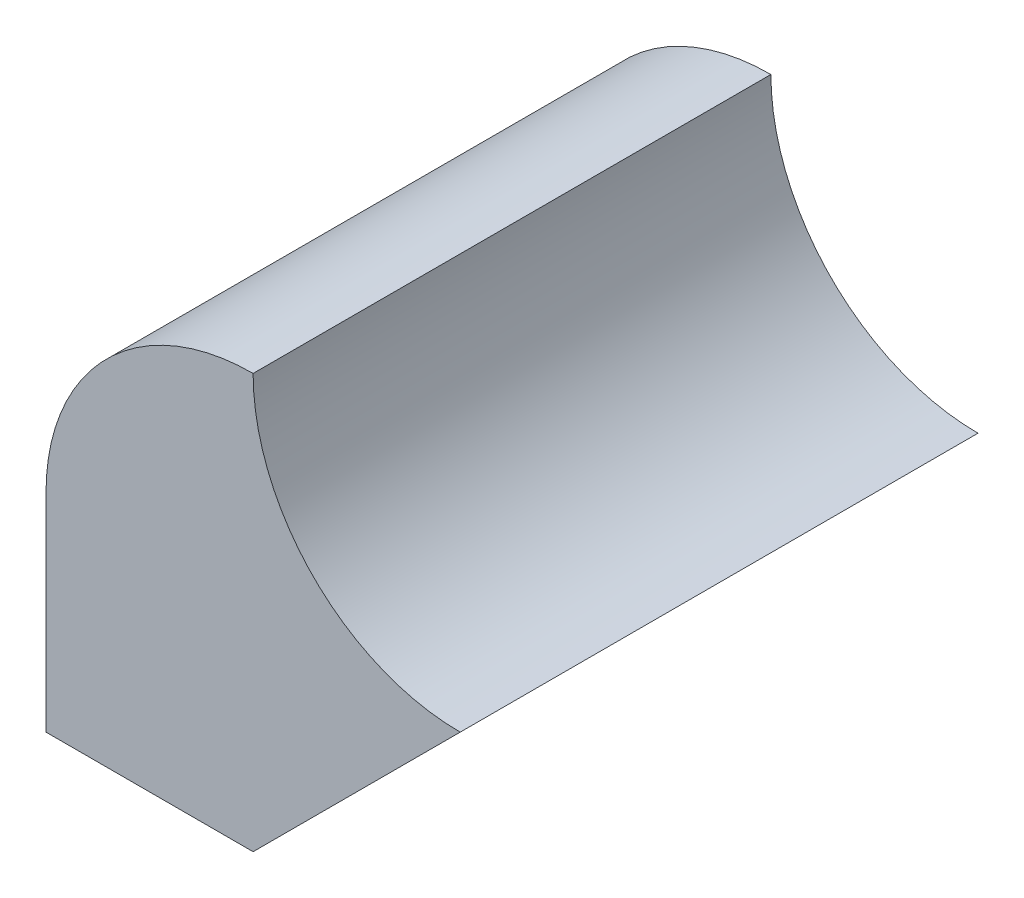
ISO-10303-21;
HEADER;
FILE_DESCRIPTION(('STEP AP214'),'2;1');
FILE_NAME('part.step','',(''),(''),'','','');
FILE_SCHEMA(('AUTOMOTIVE_DESIGN { 1 0 10303 214 1 1 1 1 }'));
ENDSEC;
DATA;
#1=APPLICATION_CONTEXT('core data for automotive mechanical design processes');
#2=APPLICATION_PROTOCOL_DEFINITION('international standard','automotive_design',2000,#1);
#3=PRODUCT_CONTEXT('',#1,'mechanical');
#4=PRODUCT('Part','Part','',(#3));
#5=PRODUCT_RELATED_PRODUCT_CATEGORY('part','',(#4));
#6=PRODUCT_DEFINITION_FORMATION('','',#4);
#7=PRODUCT_DEFINITION_CONTEXT('part definition',#1,'design');
#8=PRODUCT_DEFINITION('design','',#6,#7);
#9=PRODUCT_DEFINITION_SHAPE('','',#8);
#10=(LENGTH_UNIT() NAMED_UNIT(*) SI_UNIT(.MILLI.,.METRE.));
#11=(NAMED_UNIT(*) PLANE_ANGLE_UNIT() SI_UNIT($,.RADIAN.));
#12=(NAMED_UNIT(*) SI_UNIT($,.STERADIAN.) SOLID_ANGLE_UNIT());
#13=UNCERTAINTY_MEASURE_WITH_UNIT(LENGTH_MEASURE(1.E-05),#10,'distance_accuracy_value','');
#14=(GEOMETRIC_REPRESENTATION_CONTEXT(3) GLOBAL_UNCERTAINTY_ASSIGNED_CONTEXT((#13)) GLOBAL_UNIT_ASSIGNED_CONTEXT((#10,
#11,#12)) REPRESENTATION_CONTEXT('',''));
#15=CARTESIAN_POINT('',(0.,0.,0.));
#16=DIRECTION('',(0.,0.,1.));
#17=DIRECTION('',(1.,0.,0.));
#18=AXIS2_PLACEMENT_3D('',#15,#16,#17);
#19=CARTESIAN_POINT('',(-9.99999999999999,0.,25.));
#20=DIRECTION('',(0.,0.,-1.));
#21=DIRECTION('',(-1.,0.,0.));
#22=AXIS2_PLACEMENT_3D('',#19,#20,#21);
#23=CYLINDRICAL_SURFACE('',#22,10.);
#24=CARTESIAN_POINT('',(-9.99999999999999,0.,0.));
#25=DIRECTION('',(0.,0.,1.));
#26=DIRECTION('',(-1.,0.,0.));
#27=AXIS2_PLACEMENT_3D('',#24,#25,#26);
#28=CIRCLE('',#27,10.);
#29=CARTESIAN_POINT('',(-10.,10.,0.));
#30=VERTEX_POINT('',#29);
#31=CARTESIAN_POINT('',(-20.,0.,0.));
#32=VERTEX_POINT('',#31);
#33=EDGE_CURVE('E107',#30,#32,#28,.T.);
#34=ORIENTED_EDGE('',*,*,#33,.T.);
#35=DIRECTION('',(0.,0.,-1.));
#36=VECTOR('',#35,1.);
#37=CARTESIAN_POINT('',(-20.,0.,25.));
#38=LINE('',#37,#36);
#39=CARTESIAN_POINT('',(-20.,0.,25.));
#40=VERTEX_POINT('',#39);
#41=EDGE_CURVE('E11',#40,#32,#38,.T.);
#42=ORIENTED_EDGE('',*,*,#41,.F.);
#43=CARTESIAN_POINT('',(-9.99999999999999,0.,25.));
#44=DIRECTION('',(0.,0.,1.));
#45=DIRECTION('',(-1.,0.,0.));
#46=AXIS2_PLACEMENT_3D('',#43,#44,#45);
#47=CIRCLE('',#46,10.);
#48=CARTESIAN_POINT('',(-10.,10.,25.));
#49=VERTEX_POINT('',#48);
#50=EDGE_CURVE('E115',#49,#40,#47,.T.);
#51=ORIENTED_EDGE('',*,*,#50,.F.);
#52=DIRECTION('',(0.,0.,-1.));
#53=VECTOR('',#52,1.);
#54=CARTESIAN_POINT('',(-10.,10.,25.));
#55=LINE('',#54,#53);
#56=EDGE_CURVE('E103',#49,#30,#55,.T.);
#57=ORIENTED_EDGE('',*,*,#56,.T.);
#58=EDGE_LOOP('',(#34,#42,#51,#57));
#59=FACE_BOUND('',#58,.T.);
#60=ADVANCED_FACE('F33',(#59),#23,.T.);
#61=CARTESIAN_POINT('',(-20.,0.,25.));
#62=DIRECTION('',(1.,0.,0.));
#63=DIRECTION('',(0.,0.,-1.));
#64=AXIS2_PLACEMENT_3D('',#61,#62,#63);
#65=PLANE('',#64);
#66=DIRECTION('',(0.,-1.,0.));
#67=VECTOR('',#66,1.);
#68=CARTESIAN_POINT('',(-20.,0.,0.));
#69=LINE('',#68,#67);
#70=CARTESIAN_POINT('',(-20.,-10.,0.));
#71=VERTEX_POINT('',#70);
#72=EDGE_CURVE('E110',#32,#71,#69,.T.);
#73=ORIENTED_EDGE('',*,*,#72,.T.);
#74=DIRECTION('',(0.,0.,-1.));
#75=VECTOR('',#74,1.);
#76=CARTESIAN_POINT('',(-20.,-10.,25.));
#77=LINE('',#76,#75);
#78=CARTESIAN_POINT('',(-20.,-10.,25.));
#79=VERTEX_POINT('',#78);
#80=EDGE_CURVE('E41',#79,#71,#77,.T.);
#81=ORIENTED_EDGE('',*,*,#80,.F.);
#82=DIRECTION('',(0.,-1.,0.));
#83=VECTOR('',#82,1.);
#84=CARTESIAN_POINT('',(-20.,0.,25.));
#85=LINE('',#84,#83);
#86=EDGE_CURVE('E83',#40,#79,#85,.T.);
#87=ORIENTED_EDGE('',*,*,#86,.F.);
#88=ORIENTED_EDGE('',*,*,#41,.T.);
#89=EDGE_LOOP('',(#73,#81,#87,#88));
#90=FACE_BOUND('',#89,.T.);
#91=ADVANCED_FACE('F134',(#90),#65,.F.);
#92=CARTESIAN_POINT('',(-20.,-10.,25.));
#93=DIRECTION('',(0.,1.,0.));
#94=DIRECTION('',(0.,0.,1.));
#95=AXIS2_PLACEMENT_3D('',#92,#93,#94);
#96=PLANE('',#95);
#97=DIRECTION('',(1.,0.,0.));
#98=VECTOR('',#97,1.);
#99=CARTESIAN_POINT('',(-20.,-10.,0.));
#100=LINE('',#99,#98);
#101=CARTESIAN_POINT('',(-10.,-10.,0.));
#102=VERTEX_POINT('',#101);
#103=EDGE_CURVE('E98',#71,#102,#100,.T.);
#104=ORIENTED_EDGE('',*,*,#103,.T.);
#105=DIRECTION('',(0.,0.,-1.));
#106=VECTOR('',#105,1.);
#107=CARTESIAN_POINT('',(-10.,-10.,25.));
#108=LINE('',#107,#106);
#109=CARTESIAN_POINT('',(-10.,-10.,25.));
#110=VERTEX_POINT('',#109);
#111=EDGE_CURVE('E95',#110,#102,#108,.T.);
#112=ORIENTED_EDGE('',*,*,#111,.F.);
#113=DIRECTION('',(1.,0.,0.));
#114=VECTOR('',#113,1.);
#115=CARTESIAN_POINT('',(-20.,-10.,25.));
#116=LINE('',#115,#114);
#117=EDGE_CURVE('E87',#79,#110,#116,.T.);
#118=ORIENTED_EDGE('',*,*,#117,.F.);
#119=ORIENTED_EDGE('',*,*,#80,.T.);
#120=EDGE_LOOP('',(#104,#112,#118,#119));
#121=FACE_BOUND('',#120,.T.);
#122=ADVANCED_FACE('F96',(#121),#96,.F.);
#123=CARTESIAN_POINT('',(-10.,-10.,25.));
#124=DIRECTION('',(-0.707106781186548,0.707106781186547,0.));
#125=DIRECTION('',(-0.707106781186547,-0.707106781186548,0.));
#126=AXIS2_PLACEMENT_3D('',#123,#124,#125);
#127=PLANE('',#126);
#128=DIRECTION('',(0.707106781186547,0.707106781186548,0.));
#129=VECTOR('',#128,1.);
#130=CARTESIAN_POINT('',(-10.,-10.,0.));
#131=LINE('',#130,#129);
#132=CARTESIAN_POINT('',(0.,0.,0.));
#133=VERTEX_POINT('',#132);
#134=EDGE_CURVE('E69',#102,#133,#131,.T.);
#135=ORIENTED_EDGE('',*,*,#134,.T.);
#136=DIRECTION('',(0.,0.,-1.));
#137=VECTOR('',#136,1.);
#138=CARTESIAN_POINT('',(0.,0.,25.));
#139=LINE('',#138,#137);
#140=CARTESIAN_POINT('',(0.,0.,25.));
#141=VERTEX_POINT('',#140);
#142=EDGE_CURVE('E99',#141,#133,#139,.T.);
#143=ORIENTED_EDGE('',*,*,#142,.F.);
#144=DIRECTION('',(0.707106781186547,0.707106781186548,0.));
#145=VECTOR('',#144,1.);
#146=CARTESIAN_POINT('',(-10.,-10.,25.));
#147=LINE('',#146,#145);
#148=EDGE_CURVE('E91',#110,#141,#147,.T.);
#149=ORIENTED_EDGE('',*,*,#148,.F.);
#150=ORIENTED_EDGE('',*,*,#111,.T.);
#151=EDGE_LOOP('',(#135,#143,#149,#150));
#152=FACE_BOUND('',#151,.T.);
#153=ADVANCED_FACE('F101',(#152),#127,.F.);
#154=CARTESIAN_POINT('',(0.,10.,25.));
#155=DIRECTION('',(0.,0.,-1.));
#156=DIRECTION('',(-1.,0.,0.));
#157=AXIS2_PLACEMENT_3D('',#154,#155,#156);
#158=CYLINDRICAL_SURFACE('',#157,10.);
#159=CARTESIAN_POINT('',(0.,10.,0.));
#160=DIRECTION('',(0.,0.,-1.));
#161=DIRECTION('',(1.,0.,0.));
#162=AXIS2_PLACEMENT_3D('',#159,#160,#161);
#163=CIRCLE('',#162,10.);
#164=EDGE_CURVE('E75',#133,#30,#163,.T.);
#165=ORIENTED_EDGE('',*,*,#164,.T.);
#166=ORIENTED_EDGE('',*,*,#56,.F.);
#167=CARTESIAN_POINT('',(0.,10.,25.));
#168=DIRECTION('',(0.,0.,-1.));
#169=DIRECTION('',(1.,0.,0.));
#170=AXIS2_PLACEMENT_3D('',#167,#168,#169);
#171=CIRCLE('',#170,10.);
#172=EDGE_CURVE('E49',#141,#49,#171,.T.);
#173=ORIENTED_EDGE('',*,*,#172,.F.);
#174=ORIENTED_EDGE('',*,*,#142,.T.);
#175=EDGE_LOOP('',(#165,#166,#173,#174));
#176=FACE_BOUND('',#175,.T.);
#177=ADVANCED_FACE('F123',(#176),#158,.F.);
#178=CARTESIAN_POINT('',(-9.99999999999999,0.,25.));
#179=DIRECTION('',(0.,0.,-1.));
#180=DIRECTION('',(-1.,0.,0.));
#181=AXIS2_PLACEMENT_3D('',#178,#179,#180);
#182=PLANE('',#181);
#183=ORIENTED_EDGE('',*,*,#50,.T.);
#184=ORIENTED_EDGE('',*,*,#86,.T.);
#185=ORIENTED_EDGE('',*,*,#117,.T.);
#186=ORIENTED_EDGE('',*,*,#148,.T.);
#187=ORIENTED_EDGE('',*,*,#172,.T.);
#188=EDGE_LOOP('',(#183,#184,#185,#186,#187));
#189=FACE_BOUND('',#188,.T.);
#190=ADVANCED_FACE('F89',(#189),#182,.F.);
#191=CARTESIAN_POINT('',(-9.99999999999999,0.,0.));
#192=DIRECTION('',(0.,0.,-1.));
#193=DIRECTION('',(-1.,0.,0.));
#194=AXIS2_PLACEMENT_3D('',#191,#192,#193);
#195=PLANE('',#194);
#196=ORIENTED_EDGE('',*,*,#33,.F.);
#197=ORIENTED_EDGE('',*,*,#164,.F.);
#198=ORIENTED_EDGE('',*,*,#134,.F.);
#199=ORIENTED_EDGE('',*,*,#103,.F.);
#200=ORIENTED_EDGE('',*,*,#72,.F.);
#201=EDGE_LOOP('',(#196,#197,#198,#199,#200));
#202=FACE_BOUND('',#201,.T.);
#203=ADVANCED_FACE('F119',(#202),#195,.T.);
#204=CLOSED_SHELL('',(#60,#91,#122,#153,#177,#190,#203));
#205=MANIFOLD_SOLID_BREP('B2',#204);
#206=ADVANCED_BREP_SHAPE_REPRESENTATION('',(#18,#205),#14);
#207=SHAPE_DEFINITION_REPRESENTATION(#9,#206);
ENDSEC;
END-ISO-10303-21;
